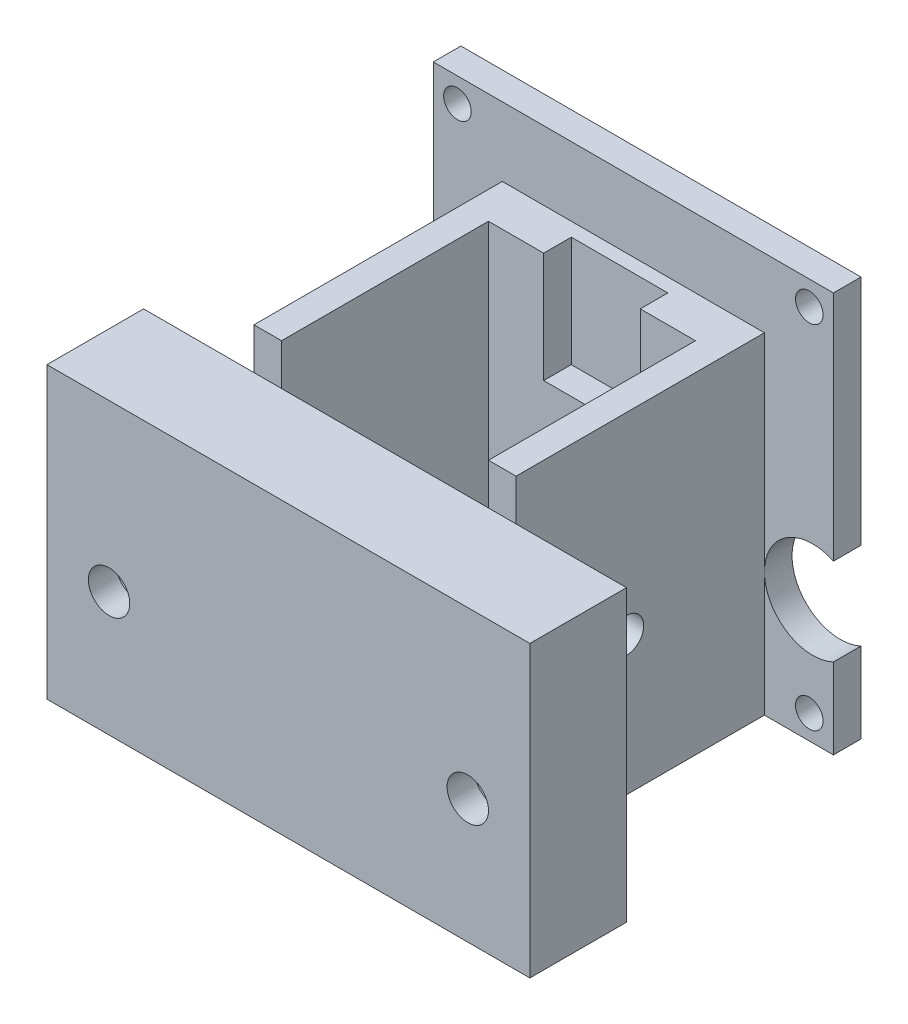
ISO-10303-21;
HEADER;
FILE_DESCRIPTION(('STEP AP214'),'2;1');
FILE_NAME('part.step','',(''),(''),'','','');
FILE_SCHEMA(('AUTOMOTIVE_DESIGN { 1 0 10303 214 1 1 1 1 }'));
ENDSEC;
DATA;
#1=APPLICATION_CONTEXT('core data for automotive mechanical design processes');
#2=APPLICATION_PROTOCOL_DEFINITION('international standard','automotive_design',2000,#1);
#3=PRODUCT_CONTEXT('',#1,'mechanical');
#4=PRODUCT('Part','Part','',(#3));
#5=PRODUCT_RELATED_PRODUCT_CATEGORY('part','',(#4));
#6=PRODUCT_DEFINITION_FORMATION('','',#4);
#7=PRODUCT_DEFINITION_CONTEXT('part definition',#1,'design');
#8=PRODUCT_DEFINITION('design','',#6,#7);
#9=PRODUCT_DEFINITION_SHAPE('','',#8);
#10=(LENGTH_UNIT() NAMED_UNIT(*) SI_UNIT(.MILLI.,.METRE.));
#11=(NAMED_UNIT(*) PLANE_ANGLE_UNIT() SI_UNIT($,.RADIAN.));
#12=(NAMED_UNIT(*) SI_UNIT($,.STERADIAN.) SOLID_ANGLE_UNIT());
#13=UNCERTAINTY_MEASURE_WITH_UNIT(LENGTH_MEASURE(1.E-05),#10,'distance_accuracy_value','');
#14=(GEOMETRIC_REPRESENTATION_CONTEXT(3) GLOBAL_UNCERTAINTY_ASSIGNED_CONTEXT((#13)) GLOBAL_UNIT_ASSIGNED_CONTEXT((#10,
#11,#12)) REPRESENTATION_CONTEXT('',''));
#15=CARTESIAN_POINT('',(0.,0.,0.));
#16=DIRECTION('',(0.,0.,1.));
#17=DIRECTION('',(1.,0.,0.));
#18=AXIS2_PLACEMENT_3D('',#15,#16,#17);
#19=CARTESIAN_POINT('',(0.,0.,2.));
#20=DIRECTION('',(0.,0.,-1.));
#21=DIRECTION('',(-1.,0.,0.));
#22=AXIS2_PLACEMENT_3D('',#19,#20,#21);
#23=PLANE('',#22);
#24=CARTESIAN_POINT('',(27.25,32.25,2.));
#25=DIRECTION('',(0.,0.,-1.));
#26=DIRECTION('',(-1.,0.,0.));
#27=AXIS2_PLACEMENT_3D('',#24,#25,#26);
#28=CIRCLE('',#27,1.);
#29=CARTESIAN_POINT('',(26.25,32.25,2.));
#30=VERTEX_POINT('',#29);
#31=EDGE_CURVE('E352',#30,#30,#28,.F.);
#32=ORIENTED_EDGE('',*,*,#31,.F.);
#33=EDGE_LOOP('',(#32));
#34=FACE_BOUND('',#33,.T.);
#35=CARTESIAN_POINT('',(1.75000000000002,32.25,2.));
#36=DIRECTION('',(0.,0.,-1.));
#37=DIRECTION('',(-1.,0.,0.));
#38=AXIS2_PLACEMENT_3D('',#35,#36,#37);
#39=CIRCLE('',#38,1.);
#40=CARTESIAN_POINT('',(0.750000000000014,32.25,2.));
#41=VERTEX_POINT('',#40);
#42=EDGE_CURVE('E366',#41,#41,#39,.F.);
#43=ORIENTED_EDGE('',*,*,#42,.F.);
#44=EDGE_LOOP('',(#43));
#45=FACE_BOUND('',#44,.T.);
#46=DIRECTION('',(0.,1.,0.));
#47=VECTOR('',#46,1.);
#48=CARTESIAN_POINT('',(24.,5.,2.));
#49=LINE('',#48,#47);
#50=CARTESIAN_POINT('',(24.,14.,2.));
#51=VERTEX_POINT('',#50);
#52=CARTESIAN_POINT('',(24.,29.,2.));
#53=VERTEX_POINT('',#52);
#54=EDGE_CURVE('E238',#51,#53,#49,.T.);
#55=ORIENTED_EDGE('',*,*,#54,.F.);
#56=CARTESIAN_POINT('',(27.5,14.,2.));
#57=DIRECTION('',(0.,0.,-1.));
#58=DIRECTION('',(-1.,0.,0.));
#59=AXIS2_PLACEMENT_3D('',#56,#57,#58);
#60=CIRCLE('',#59,3.5);
#61=CARTESIAN_POINT('',(29.,17.1622776601684,2.));
#62=VERTEX_POINT('',#61);
#63=EDGE_CURVE('E216',#62,#51,#60,.F.);
#64=ORIENTED_EDGE('',*,*,#63,.F.);
#65=DIRECTION('',(0.,1.,0.));
#66=VECTOR('',#65,1.);
#67=CARTESIAN_POINT('',(29.,0.,2.));
#68=LINE('',#67,#66);
#69=CARTESIAN_POINT('',(29.,34.,2.));
#70=VERTEX_POINT('',#69);
#71=EDGE_CURVE('E269',#62,#70,#68,.T.);
#72=ORIENTED_EDGE('',*,*,#71,.T.);
#73=DIRECTION('',(1.,0.,0.));
#74=VECTOR('',#73,1.);
#75=CARTESIAN_POINT('',(0.,34.,2.));
#76=LINE('',#75,#74);
#77=CARTESIAN_POINT('',(0.,34.,2.));
#78=VERTEX_POINT('',#77);
#79=EDGE_CURVE('E372',#78,#70,#76,.T.);
#80=ORIENTED_EDGE('',*,*,#79,.F.);
#81=DIRECTION('',(0.,-1.,0.));
#82=VECTOR('',#81,1.);
#83=CARTESIAN_POINT('',(0.,0.,2.));
#84=LINE('',#83,#82);
#85=CARTESIAN_POINT('',(0.,17.1622776601684,2.));
#86=VERTEX_POINT('',#85);
#87=EDGE_CURVE('E266',#78,#86,#84,.T.);
#88=ORIENTED_EDGE('',*,*,#87,.T.);
#89=CARTESIAN_POINT('',(1.5,14.,2.));
#90=DIRECTION('',(0.,0.,-1.));
#91=DIRECTION('',(-1.,0.,0.));
#92=AXIS2_PLACEMENT_3D('',#89,#90,#91);
#93=CIRCLE('',#92,3.5);
#94=CARTESIAN_POINT('',(5.,14.,2.));
#95=VERTEX_POINT('',#94);
#96=EDGE_CURVE('E598',#95,#86,#93,.F.);
#97=ORIENTED_EDGE('',*,*,#96,.F.);
#98=DIRECTION('',(0.,-1.,0.));
#99=VECTOR('',#98,1.);
#100=CARTESIAN_POINT('',(5.,5.,2.));
#101=LINE('',#100,#99);
#102=CARTESIAN_POINT('',(4.99999999999999,29.,2.));
#103=VERTEX_POINT('',#102);
#104=EDGE_CURVE('E243',#103,#95,#101,.T.);
#105=ORIENTED_EDGE('',*,*,#104,.F.);
#106=DIRECTION('',(1.,0.,0.));
#107=VECTOR('',#106,1.);
#108=CARTESIAN_POINT('',(0.,29.,2.));
#109=LINE('',#108,#107);
#110=EDGE_CURVE('E48',#103,#53,#109,.T.);
#111=ORIENTED_EDGE('',*,*,#110,.T.);
#112=EDGE_LOOP('',(#55,#64,#72,#80,#88,#97,#105,#111));
#113=FACE_BOUND('',#112,.T.);
#114=ADVANCED_FACE('F40',(#34,#45,#113),#23,.F.);
#115=CARTESIAN_POINT('',(27.25,6.75000000000003,2.));
#116=DIRECTION('',(0.,0.,-1.));
#117=DIRECTION('',(-1.,0.,0.));
#118=AXIS2_PLACEMENT_3D('',#115,#116,#117);
#119=CIRCLE('',#118,1.);
#120=CARTESIAN_POINT('',(26.25,6.75000000000003,2.));
#121=VERTEX_POINT('',#120);
#122=EDGE_CURVE('E353',#121,#121,#119,.F.);
#123=ORIENTED_EDGE('',*,*,#122,.F.);
#124=EDGE_LOOP('',(#123));
#125=FACE_BOUND('',#124,.T.);
#126=CARTESIAN_POINT('',(29.,5.,2.));
#127=VERTEX_POINT('',#126);
#128=CARTESIAN_POINT('',(29.,10.8377223398316,2.));
#129=VERTEX_POINT('',#128);
#130=EDGE_CURVE('E236',#127,#129,#68,.T.);
#131=ORIENTED_EDGE('',*,*,#130,.T.);
#132=EDGE_CURVE('E219',#51,#129,#60,.F.);
#133=ORIENTED_EDGE('',*,*,#132,.F.);
#134=CARTESIAN_POINT('',(24.,5.,2.));
#135=VERTEX_POINT('',#134);
#136=EDGE_CURVE('E233',#135,#51,#49,.T.);
#137=ORIENTED_EDGE('',*,*,#136,.F.);
#138=DIRECTION('',(-1.,0.,0.));
#139=VECTOR('',#138,1.);
#140=CARTESIAN_POINT('',(22.5,5.,2.));
#141=LINE('',#140,#139);
#142=EDGE_CURVE('E386',#127,#135,#141,.T.);
#143=ORIENTED_EDGE('',*,*,#142,.F.);
#144=EDGE_LOOP('',(#131,#133,#137,#143));
#145=FACE_BOUND('',#144,.T.);
#146=ADVANCED_FACE('F230',(#125,#145),#23,.F.);
#147=CARTESIAN_POINT('',(0.,0.,2.));
#148=DIRECTION('',(1.,0.,0.));
#149=DIRECTION('',(0.,1.,0.));
#150=AXIS2_PLACEMENT_3D('',#147,#148,#149);
#151=PLANE('',#150);
#152=CARTESIAN_POINT('',(0.,10.8377223398316,2.));
#153=VERTEX_POINT('',#152);
#154=CARTESIAN_POINT('',(0.,5.,2.));
#155=VERTEX_POINT('',#154);
#156=EDGE_CURVE('E270',#153,#155,#84,.T.);
#157=ORIENTED_EDGE('',*,*,#156,.F.);
#158=DIRECTION('',(0.,0.,-1.));
#159=VECTOR('',#158,1.);
#160=CARTESIAN_POINT('',(0.,10.8377223398316,11.8994949366117));
#161=LINE('',#160,#159);
#162=CARTESIAN_POINT('',(0.,10.8377223398316,0.));
#163=VERTEX_POINT('',#162);
#164=EDGE_CURVE('E496',#153,#163,#161,.T.);
#165=ORIENTED_EDGE('',*,*,#164,.T.);
#166=DIRECTION('',(0.,-1.,0.));
#167=VECTOR('',#166,1.);
#168=CARTESIAN_POINT('',(0.,0.,0.));
#169=LINE('',#168,#167);
#170=CARTESIAN_POINT('',(0.,5.,0.));
#171=VERTEX_POINT('',#170);
#172=EDGE_CURVE('E265',#163,#171,#169,.T.);
#173=ORIENTED_EDGE('',*,*,#172,.T.);
#174=DIRECTION('',(0.,0.,-1.));
#175=VECTOR('',#174,1.);
#176=CARTESIAN_POINT('',(0.,5.,10.2006097334284));
#177=LINE('',#176,#175);
#178=EDGE_CURVE('E381',#155,#171,#177,.T.);
#179=ORIENTED_EDGE('',*,*,#178,.F.);
#180=EDGE_LOOP('',(#157,#165,#173,#179));
#181=FACE_BOUND('',#180,.T.);
#182=ADVANCED_FACE('F492',(#181),#151,.F.);
#183=CARTESIAN_POINT('',(29.,0.,2.));
#184=DIRECTION('',(-1.,0.,0.));
#185=DIRECTION('',(0.,-1.,0.));
#186=AXIS2_PLACEMENT_3D('',#183,#184,#185);
#187=PLANE('',#186);
#188=ORIENTED_EDGE('',*,*,#71,.F.);
#189=DIRECTION('',(0.,0.,-1.));
#190=VECTOR('',#189,1.);
#191=CARTESIAN_POINT('',(29.,17.1622776601684,11.8994949366117));
#192=LINE('',#191,#190);
#193=CARTESIAN_POINT('',(29.,17.1622776601684,0.));
#194=VERTEX_POINT('',#193);
#195=EDGE_CURVE('E221',#62,#194,#192,.T.);
#196=ORIENTED_EDGE('',*,*,#195,.T.);
#197=DIRECTION('',(0.,1.,0.));
#198=VECTOR('',#197,1.);
#199=CARTESIAN_POINT('',(29.,0.,0.));
#200=LINE('',#199,#198);
#201=CARTESIAN_POINT('',(29.,34.,0.));
#202=VERTEX_POINT('',#201);
#203=EDGE_CURVE('E275',#194,#202,#200,.T.);
#204=ORIENTED_EDGE('',*,*,#203,.T.);
#205=DIRECTION('',(0.,0.,-1.));
#206=VECTOR('',#205,1.);
#207=CARTESIAN_POINT('',(29.,34.,2.));
#208=LINE('',#207,#206);
#209=EDGE_CURVE('E375',#70,#202,#208,.T.);
#210=ORIENTED_EDGE('',*,*,#209,.F.);
#211=EDGE_LOOP('',(#188,#196,#204,#210));
#212=FACE_BOUND('',#211,.T.);
#213=ADVANCED_FACE('F593',(#212),#187,.F.);
#214=CARTESIAN_POINT('',(0.,29.,2.));
#215=DIRECTION('',(0.,-1.,0.));
#216=DIRECTION('',(0.,0.,-1.));
#217=AXIS2_PLACEMENT_3D('',#214,#215,#216);
#218=PLANE('',#217);
#219=DIRECTION('',(1.,0.,0.));
#220=VECTOR('',#219,1.);
#221=CARTESIAN_POINT('',(-3.00000000000001,29.,20.));
#222=LINE('',#221,#220);
#223=CARTESIAN_POINT('',(22.,29.,20.));
#224=VERTEX_POINT('',#223);
#225=CARTESIAN_POINT('',(24.,29.,20.));
#226=VERTEX_POINT('',#225);
#227=EDGE_CURVE('E509',#224,#226,#222,.T.);
#228=ORIENTED_EDGE('',*,*,#227,.T.);
#229=DIRECTION('',(0.,0.,-1.));
#230=VECTOR('',#229,1.);
#231=CARTESIAN_POINT('',(24.,29.,20.));
#232=LINE('',#231,#230);
#233=EDGE_CURVE('E258',#226,#53,#232,.T.);
#234=ORIENTED_EDGE('',*,*,#233,.T.);
#235=ORIENTED_EDGE('',*,*,#110,.F.);
#236=DIRECTION('',(0.,0.,-1.));
#237=VECTOR('',#236,1.);
#238=CARTESIAN_POINT('',(5.,29.,20.));
#239=LINE('',#238,#237);
#240=CARTESIAN_POINT('',(5.,29.,20.));
#241=VERTEX_POINT('',#240);
#242=EDGE_CURVE('E255',#241,#103,#239,.T.);
#243=ORIENTED_EDGE('',*,*,#242,.F.);
#244=CARTESIAN_POINT('',(7.,29.,20.));
#245=VERTEX_POINT('',#244);
#246=EDGE_CURVE('E511',#241,#245,#222,.T.);
#247=ORIENTED_EDGE('',*,*,#246,.T.);
#248=DIRECTION('',(0.,0.,1.));
#249=VECTOR('',#248,1.);
#250=CARTESIAN_POINT('',(7.,29.,-26.3019433961698));
#251=LINE('',#250,#249);
#252=CARTESIAN_POINT('',(7.,29.,5.));
#253=VERTEX_POINT('',#252);
#254=EDGE_CURVE('E310',#253,#245,#251,.T.);
#255=ORIENTED_EDGE('',*,*,#254,.F.);
#256=DIRECTION('',(-1.,0.,0.));
#257=VECTOR('',#256,1.);
#258=CARTESIAN_POINT('',(7.,29.,5.));
#259=LINE('',#258,#257);
#260=CARTESIAN_POINT('',(11.,29.,5.));
#261=VERTEX_POINT('',#260);
#262=EDGE_CURVE('E314',#261,#253,#259,.T.);
#263=ORIENTED_EDGE('',*,*,#262,.F.);
#264=DIRECTION('',(0.,0.,1.));
#265=VECTOR('',#264,1.);
#266=CARTESIAN_POINT('',(11.,29.,3.));
#267=LINE('',#266,#265);
#268=CARTESIAN_POINT('',(11.,29.,3.));
#269=VERTEX_POINT('',#268);
#270=EDGE_CURVE('E413',#269,#261,#267,.T.);
#271=ORIENTED_EDGE('',*,*,#270,.F.);
#272=DIRECTION('',(-1.,0.,0.));
#273=VECTOR('',#272,1.);
#274=CARTESIAN_POINT('',(11.,29.,3.));
#275=LINE('',#274,#273);
#276=CARTESIAN_POINT('',(18.,29.,3.));
#277=VERTEX_POINT('',#276);
#278=EDGE_CURVE('E404',#277,#269,#275,.T.);
#279=ORIENTED_EDGE('',*,*,#278,.F.);
#280=DIRECTION('',(0.,0.,1.));
#281=VECTOR('',#280,1.);
#282=CARTESIAN_POINT('',(18.,29.,3.));
#283=LINE('',#282,#281);
#284=CARTESIAN_POINT('',(18.,29.,5.));
#285=VERTEX_POINT('',#284);
#286=EDGE_CURVE('E416',#277,#285,#283,.T.);
#287=ORIENTED_EDGE('',*,*,#286,.T.);
#288=CARTESIAN_POINT('',(22.,29.,5.));
#289=VERTEX_POINT('',#288);
#290=EDGE_CURVE('E311',#289,#285,#259,.T.);
#291=ORIENTED_EDGE('',*,*,#290,.F.);
#292=DIRECTION('',(0.,0.,1.));
#293=VECTOR('',#292,1.);
#294=CARTESIAN_POINT('',(22.,29.,-26.3019433961698));
#295=LINE('',#294,#293);
#296=EDGE_CURVE('E318',#289,#224,#295,.T.);
#297=ORIENTED_EDGE('',*,*,#296,.T.);
#298=EDGE_LOOP('',(#228,#234,#235,#243,#247,#255,#263,#271,#279,#287,#291,#297));
#299=FACE_BOUND('',#298,.T.);
#300=ADVANCED_FACE('F528',(#299),#218,.F.);
#301=CARTESIAN_POINT('',(1.74999999999998,6.74999999999998,2.));
#302=DIRECTION('',(0.,0.,-1.));
#303=DIRECTION('',(-1.,0.,0.));
#304=AXIS2_PLACEMENT_3D('',#301,#302,#303);
#305=CIRCLE('',#304,1.);
#306=CARTESIAN_POINT('',(0.74999999999998,6.74999999999998,2.));
#307=VERTEX_POINT('',#306);
#308=EDGE_CURVE('E344',#307,#307,#305,.F.);
#309=ORIENTED_EDGE('',*,*,#308,.F.);
#310=EDGE_LOOP('',(#309));
#311=FACE_BOUND('',#310,.T.);
#312=CARTESIAN_POINT('',(5.,5.,2.));
#313=VERTEX_POINT('',#312);
#314=EDGE_CURVE('E326',#95,#313,#101,.T.);
#315=ORIENTED_EDGE('',*,*,#314,.F.);
#316=EDGE_CURVE('E225',#153,#95,#93,.F.);
#317=ORIENTED_EDGE('',*,*,#316,.F.);
#318=ORIENTED_EDGE('',*,*,#156,.T.);
#319=DIRECTION('',(-1.,0.,0.));
#320=VECTOR('',#319,1.);
#321=CARTESIAN_POINT('',(5.5,5.,2.));
#322=LINE('',#321,#320);
#323=EDGE_CURVE('E387',#313,#155,#322,.T.);
#324=ORIENTED_EDGE('',*,*,#323,.F.);
#325=EDGE_LOOP('',(#315,#317,#318,#324));
#326=FACE_BOUND('',#325,.T.);
#327=ADVANCED_FACE('F578',(#311,#326),#23,.F.);
#328=CARTESIAN_POINT('',(0.,34.,0.));
#329=VERTEX_POINT('',#328);
#330=CARTESIAN_POINT('',(0.,17.1622776601684,0.));
#331=VERTEX_POINT('',#330);
#332=EDGE_CURVE('E272',#329,#331,#169,.T.);
#333=ORIENTED_EDGE('',*,*,#332,.T.);
#334=DIRECTION('',(0.,0.,-1.));
#335=VECTOR('',#334,1.);
#336=CARTESIAN_POINT('',(0.,17.1622776601684,11.8994949366117));
#337=LINE('',#336,#335);
#338=EDGE_CURVE('E55',#331,#86,#337,.F.);
#339=ORIENTED_EDGE('',*,*,#338,.T.);
#340=ORIENTED_EDGE('',*,*,#87,.F.);
#341=DIRECTION('',(0.,0.,1.));
#342=VECTOR('',#341,1.);
#343=CARTESIAN_POINT('',(0.,34.,2.));
#344=LINE('',#343,#342);
#345=EDGE_CURVE('E369',#329,#78,#344,.T.);
#346=ORIENTED_EDGE('',*,*,#345,.F.);
#347=EDGE_LOOP('',(#333,#339,#340,#346));
#348=FACE_BOUND('',#347,.T.);
#349=ADVANCED_FACE('F42',(#348),#151,.F.);
#350=CARTESIAN_POINT('',(29.,5.,0.));
#351=VERTEX_POINT('',#350);
#352=CARTESIAN_POINT('',(29.,10.8377223398316,0.));
#353=VERTEX_POINT('',#352);
#354=EDGE_CURVE('E276',#351,#353,#200,.T.);
#355=ORIENTED_EDGE('',*,*,#354,.T.);
#356=DIRECTION('',(0.,0.,-1.));
#357=VECTOR('',#356,1.);
#358=CARTESIAN_POINT('',(29.,10.8377223398316,11.8994949366117));
#359=LINE('',#358,#357);
#360=EDGE_CURVE('E62',#353,#129,#359,.F.);
#361=ORIENTED_EDGE('',*,*,#360,.T.);
#362=ORIENTED_EDGE('',*,*,#130,.F.);
#363=DIRECTION('',(0.,0.,-1.));
#364=VECTOR('',#363,1.);
#365=CARTESIAN_POINT('',(29.,5.,10.2006097334284));
#366=LINE('',#365,#364);
#367=EDGE_CURVE('E383',#127,#351,#366,.T.);
#368=ORIENTED_EDGE('',*,*,#367,.T.);
#369=EDGE_LOOP('',(#355,#361,#362,#368));
#370=FACE_BOUND('',#369,.T.);
#371=ADVANCED_FACE('F502',(#370),#187,.F.);
#372=CARTESIAN_POINT('',(0.,0.,0.));
#373=DIRECTION('',(0.,0.,-1.));
#374=DIRECTION('',(-1.,0.,0.));
#375=AXIS2_PLACEMENT_3D('',#372,#373,#374);
#376=PLANE('',#375);
#377=CARTESIAN_POINT('',(27.5,14.,0.));
#378=DIRECTION('',(0.,0.,-1.));
#379=DIRECTION('',(-1.,0.,0.));
#380=AXIS2_PLACEMENT_3D('',#377,#378,#379);
#381=CIRCLE('',#380,3.5);
#382=EDGE_CURVE('E13',#353,#194,#381,.T.);
#383=ORIENTED_EDGE('',*,*,#382,.F.);
#384=ORIENTED_EDGE('',*,*,#354,.F.);
#385=DIRECTION('',(1.,0.,0.));
#386=VECTOR('',#385,1.);
#387=CARTESIAN_POINT('',(5.5,5.,0.));
#388=LINE('',#387,#386);
#389=EDGE_CURVE('E430',#171,#351,#388,.T.);
#390=ORIENTED_EDGE('',*,*,#389,.F.);
#391=ORIENTED_EDGE('',*,*,#172,.F.);
#392=CARTESIAN_POINT('',(1.5,14.,0.));
#393=DIRECTION('',(0.,0.,-1.));
#394=DIRECTION('',(-1.,0.,0.));
#395=AXIS2_PLACEMENT_3D('',#392,#393,#394);
#396=CIRCLE('',#395,3.5);
#397=EDGE_CURVE('E600',#331,#163,#396,.T.);
#398=ORIENTED_EDGE('',*,*,#397,.F.);
#399=ORIENTED_EDGE('',*,*,#332,.F.);
#400=DIRECTION('',(-1.,0.,0.));
#401=VECTOR('',#400,1.);
#402=CARTESIAN_POINT('',(0.,34.,0.));
#403=LINE('',#402,#401);
#404=EDGE_CURVE('E378',#202,#329,#403,.T.);
#405=ORIENTED_EDGE('',*,*,#404,.F.);
#406=ORIENTED_EDGE('',*,*,#203,.F.);
#407=EDGE_LOOP('',(#383,#384,#390,#391,#398,#399,#405,#406));
#408=FACE_BOUND('',#407,.T.);
#409=CARTESIAN_POINT('',(1.74999999999998,6.74999999999998,0.));
#410=DIRECTION('',(0.,0.,-1.));
#411=DIRECTION('',(-1.,0.,0.));
#412=AXIS2_PLACEMENT_3D('',#409,#410,#411);
#413=CIRCLE('',#412,1.);
#414=CARTESIAN_POINT('',(0.74999999999998,6.74999999999998,0.));
#415=VERTEX_POINT('',#414);
#416=EDGE_CURVE('E340',#415,#415,#413,.T.);
#417=ORIENTED_EDGE('',*,*,#416,.F.);
#418=EDGE_LOOP('',(#417));
#419=FACE_BOUND('',#418,.T.);
#420=CARTESIAN_POINT('',(27.25,6.75000000000003,0.));
#421=DIRECTION('',(0.,0.,-1.));
#422=DIRECTION('',(-1.,0.,0.));
#423=AXIS2_PLACEMENT_3D('',#420,#421,#422);
#424=CIRCLE('',#423,1.);
#425=CARTESIAN_POINT('',(26.25,6.75000000000003,0.));
#426=VERTEX_POINT('',#425);
#427=EDGE_CURVE('E357',#426,#426,#424,.T.);
#428=ORIENTED_EDGE('',*,*,#427,.F.);
#429=EDGE_LOOP('',(#428));
#430=FACE_BOUND('',#429,.T.);
#431=CARTESIAN_POINT('',(27.25,32.25,0.));
#432=DIRECTION('',(0.,0.,-1.));
#433=DIRECTION('',(-1.,0.,0.));
#434=AXIS2_PLACEMENT_3D('',#431,#432,#433);
#435=CIRCLE('',#434,1.);
#436=CARTESIAN_POINT('',(26.25,32.25,0.));
#437=VERTEX_POINT('',#436);
#438=EDGE_CURVE('E349',#437,#437,#435,.T.);
#439=ORIENTED_EDGE('',*,*,#438,.F.);
#440=EDGE_LOOP('',(#439));
#441=FACE_BOUND('',#440,.T.);
#442=CARTESIAN_POINT('',(1.75000000000002,32.25,0.));
#443=DIRECTION('',(0.,0.,-1.));
#444=DIRECTION('',(-1.,0.,0.));
#445=AXIS2_PLACEMENT_3D('',#442,#443,#444);
#446=CIRCLE('',#445,1.);
#447=CARTESIAN_POINT('',(0.750000000000014,32.25,0.));
#448=VERTEX_POINT('',#447);
#449=EDGE_CURVE('E356',#448,#448,#446,.T.);
#450=ORIENTED_EDGE('',*,*,#449,.F.);
#451=EDGE_LOOP('',(#450));
#452=FACE_BOUND('',#451,.T.);
#453=ADVANCED_FACE('F499',(#408,#419,#430,#441,#452),#376,.T.);
#454=CARTESIAN_POINT('',(5.,5.,20.));
#455=DIRECTION('',(1.,0.,0.));
#456=DIRECTION('',(0.,0.,-1.));
#457=AXIS2_PLACEMENT_3D('',#454,#455,#456);
#458=PLANE('',#457);
#459=CARTESIAN_POINT('',(5.,15.,12.));
#460=DIRECTION('',(-1.,0.,0.));
#461=DIRECTION('',(0.,0.,1.));
#462=AXIS2_PLACEMENT_3D('',#459,#460,#461);
#463=CIRCLE('',#462,1.25);
#464=CARTESIAN_POINT('',(5.,15.,13.25));
#465=VERTEX_POINT('',#464);
#466=EDGE_CURVE('E288',#465,#465,#463,.T.);
#467=ORIENTED_EDGE('',*,*,#466,.F.);
#468=EDGE_LOOP('',(#467));
#469=FACE_BOUND('',#468,.T.);
#470=ORIENTED_EDGE('',*,*,#104,.T.);
#471=ORIENTED_EDGE('',*,*,#314,.T.);
#472=DIRECTION('',(0.,0.,-1.));
#473=VECTOR('',#472,1.);
#474=CARTESIAN_POINT('',(5.,5.,20.));
#475=LINE('',#474,#473);
#476=CARTESIAN_POINT('',(5.,5.,20.));
#477=VERTEX_POINT('',#476);
#478=EDGE_CURVE('E262',#477,#313,#475,.T.);
#479=ORIENTED_EDGE('',*,*,#478,.F.);
#480=DIRECTION('',(0.,-1.,0.));
#481=VECTOR('',#480,1.);
#482=CARTESIAN_POINT('',(5.,5.,20.));
#483=LINE('',#482,#481);
#484=CARTESIAN_POINT('',(5.,26.,20.));
#485=VERTEX_POINT('',#484);
#486=EDGE_CURVE('E249',#485,#477,#483,.T.);
#487=ORIENTED_EDGE('',*,*,#486,.F.);
#488=EDGE_CURVE('E250',#241,#485,#483,.T.);
#489=ORIENTED_EDGE('',*,*,#488,.F.);
#490=ORIENTED_EDGE('',*,*,#242,.T.);
#491=EDGE_LOOP('',(#470,#471,#479,#487,#489,#490));
#492=FACE_BOUND('',#491,.T.);
#493=ADVANCED_FACE('F485',(#469,#492),#458,.F.);
#494=CARTESIAN_POINT('',(5.,5.,20.));
#495=DIRECTION('',(0.,1.,0.));
#496=DIRECTION('',(0.,0.,1.));
#497=AXIS2_PLACEMENT_3D('',#494,#495,#496);
#498=PLANE('',#497);
#499=ORIENTED_EDGE('',*,*,#142,.T.);
#500=DIRECTION('',(0.,0.,-1.));
#501=VECTOR('',#500,1.);
#502=CARTESIAN_POINT('',(24.,5.,20.));
#503=LINE('',#502,#501);
#504=CARTESIAN_POINT('',(24.,5.,20.));
#505=VERTEX_POINT('',#504);
#506=EDGE_CURVE('E248',#505,#135,#503,.T.);
#507=ORIENTED_EDGE('',*,*,#506,.F.);
#508=DIRECTION('',(1.,0.,0.));
#509=VECTOR('',#508,1.);
#510=CARTESIAN_POINT('',(32.,5.,20.));
#511=LINE('',#510,#509);
#512=CARTESIAN_POINT('',(32.,5.,20.));
#513=VERTEX_POINT('',#512);
#514=EDGE_CURVE('E335',#505,#513,#511,.T.);
#515=ORIENTED_EDGE('',*,*,#514,.T.);
#516=DIRECTION('',(0.,0.,-1.));
#517=VECTOR('',#516,1.);
#518=CARTESIAN_POINT('',(32.,5.,27.));
#519=LINE('',#518,#517);
#520=CARTESIAN_POINT('',(32.,5.,27.));
#521=VERTEX_POINT('',#520);
#522=EDGE_CURVE('E457',#521,#513,#519,.T.);
#523=ORIENTED_EDGE('',*,*,#522,.F.);
#524=DIRECTION('',(1.,0.,0.));
#525=VECTOR('',#524,1.);
#526=CARTESIAN_POINT('',(32.,5.,27.));
#527=LINE('',#526,#525);
#528=CARTESIAN_POINT('',(-3.00000000000001,5.,27.));
#529=VERTEX_POINT('',#528);
#530=EDGE_CURVE('E455',#529,#521,#527,.T.);
#531=ORIENTED_EDGE('',*,*,#530,.F.);
#532=DIRECTION('',(0.,0.,-1.));
#533=VECTOR('',#532,1.);
#534=CARTESIAN_POINT('',(-3.00000000000001,5.,27.));
#535=LINE('',#534,#533);
#536=CARTESIAN_POINT('',(-3.00000000000001,5.,20.));
#537=VERTEX_POINT('',#536);
#538=EDGE_CURVE('E293',#529,#537,#535,.T.);
#539=ORIENTED_EDGE('',*,*,#538,.T.);
#540=EDGE_CURVE('E453',#537,#477,#511,.T.);
#541=ORIENTED_EDGE('',*,*,#540,.T.);
#542=ORIENTED_EDGE('',*,*,#478,.T.);
#543=ORIENTED_EDGE('',*,*,#323,.T.);
#544=ORIENTED_EDGE('',*,*,#178,.T.);
#545=ORIENTED_EDGE('',*,*,#389,.T.);
#546=ORIENTED_EDGE('',*,*,#367,.F.);
#547=EDGE_LOOP('',(#499,#507,#515,#523,#531,#539,#541,#542,#543,#544,#545,#546));
#548=FACE_BOUND('',#547,.T.);
#549=CARTESIAN_POINT('',(7.,5.,20.));
#550=VERTEX_POINT('',#549);
#551=CARTESIAN_POINT('',(22.,5.,20.));
#552=VERTEX_POINT('',#551);
#553=EDGE_CURVE('E463',#550,#552,#511,.T.);
#554=ORIENTED_EDGE('',*,*,#553,.T.);
#555=DIRECTION('',(0.,0.,1.));
#556=VECTOR('',#555,1.);
#557=CARTESIAN_POINT('',(22.,5.,-26.3019433961698));
#558=LINE('',#557,#556);
#559=CARTESIAN_POINT('',(22.,5.,5.));
#560=VERTEX_POINT('',#559);
#561=EDGE_CURVE('E306',#560,#552,#558,.T.);
#562=ORIENTED_EDGE('',*,*,#561,.F.);
#563=DIRECTION('',(1.,0.,0.));
#564=VECTOR('',#563,1.);
#565=CARTESIAN_POINT('',(7.,5.,5.));
#566=LINE('',#565,#564);
#567=CARTESIAN_POINT('',(7.,5.,5.));
#568=VERTEX_POINT('',#567);
#569=EDGE_CURVE('E300',#568,#560,#566,.T.);
#570=ORIENTED_EDGE('',*,*,#569,.F.);
#571=DIRECTION('',(0.,0.,1.));
#572=VECTOR('',#571,1.);
#573=CARTESIAN_POINT('',(7.,5.,-26.3019433961698));
#574=LINE('',#573,#572);
#575=EDGE_CURVE('E309',#568,#550,#574,.T.);
#576=ORIENTED_EDGE('',*,*,#575,.T.);
#577=EDGE_LOOP('',(#554,#562,#570,#576));
#578=FACE_BOUND('',#577,.T.);
#579=ADVANCED_FACE('F470',(#548,#578),#498,.F.);
#580=CARTESIAN_POINT('',(24.,5.,20.));
#581=DIRECTION('',(-1.,0.,0.));
#582=DIRECTION('',(0.,0.,1.));
#583=AXIS2_PLACEMENT_3D('',#580,#581,#582);
#584=PLANE('',#583);
#585=CARTESIAN_POINT('',(24.,15.,12.));
#586=DIRECTION('',(-1.,0.,0.));
#587=DIRECTION('',(0.,0.,1.));
#588=AXIS2_PLACEMENT_3D('',#585,#586,#587);
#589=CIRCLE('',#588,1.25);
#590=CARTESIAN_POINT('',(24.,15.,13.25));
#591=VERTEX_POINT('',#590);
#592=EDGE_CURVE('E281',#591,#591,#589,.F.);
#593=ORIENTED_EDGE('',*,*,#592,.F.);
#594=EDGE_LOOP('',(#593));
#595=FACE_BOUND('',#594,.T.);
#596=ORIENTED_EDGE('',*,*,#136,.T.);
#597=ORIENTED_EDGE('',*,*,#54,.T.);
#598=ORIENTED_EDGE('',*,*,#233,.F.);
#599=DIRECTION('',(0.,1.,0.));
#600=VECTOR('',#599,1.);
#601=CARTESIAN_POINT('',(24.,5.,20.));
#602=LINE('',#601,#600);
#603=CARTESIAN_POINT('',(24.,26.,20.));
#604=VERTEX_POINT('',#603);
#605=EDGE_CURVE('E337',#604,#226,#602,.T.);
#606=ORIENTED_EDGE('',*,*,#605,.F.);
#607=DIRECTION('',(0.,1.,0.));
#608=VECTOR('',#607,1.);
#609=CARTESIAN_POINT('',(24.,5.,20.));
#610=LINE('',#609,#608);
#611=EDGE_CURVE('E259',#505,#604,#610,.T.);
#612=ORIENTED_EDGE('',*,*,#611,.F.);
#613=ORIENTED_EDGE('',*,*,#506,.T.);
#614=EDGE_LOOP('',(#596,#597,#598,#606,#612,#613));
#615=FACE_BOUND('',#614,.T.);
#616=ADVANCED_FACE('F245',(#595,#615),#584,.F.);
#617=CARTESIAN_POINT('',(0.,0.,5.));
#618=DIRECTION('',(0.,0.,-1.));
#619=DIRECTION('',(-1.,0.,0.));
#620=AXIS2_PLACEMENT_3D('',#617,#618,#619);
#621=PLANE('',#620);
#622=DIRECTION('',(1.,0.,0.));
#623=VECTOR('',#622,1.);
#624=CARTESIAN_POINT('',(11.,21.,5.));
#625=LINE('',#624,#623);
#626=CARTESIAN_POINT('',(11.,21.,5.));
#627=VERTEX_POINT('',#626);
#628=CARTESIAN_POINT('',(18.,21.,5.));
#629=VERTEX_POINT('',#628);
#630=EDGE_CURVE('E409',#627,#629,#625,.T.);
#631=ORIENTED_EDGE('',*,*,#630,.F.);
#632=DIRECTION('',(0.,-1.,0.));
#633=VECTOR('',#632,1.);
#634=CARTESIAN_POINT('',(11.,29.,5.));
#635=LINE('',#634,#633);
#636=EDGE_CURVE('E389',#261,#627,#635,.T.);
#637=ORIENTED_EDGE('',*,*,#636,.F.);
#638=ORIENTED_EDGE('',*,*,#262,.T.);
#639=DIRECTION('',(0.,-1.,0.));
#640=VECTOR('',#639,1.);
#641=CARTESIAN_POINT('',(7.,5.,5.));
#642=LINE('',#641,#640);
#643=EDGE_CURVE('E307',#253,#568,#642,.T.);
#644=ORIENTED_EDGE('',*,*,#643,.T.);
#645=ORIENTED_EDGE('',*,*,#569,.T.);
#646=DIRECTION('',(0.,1.,0.));
#647=VECTOR('',#646,1.);
#648=CARTESIAN_POINT('',(22.,5.,5.));
#649=LINE('',#648,#647);
#650=EDGE_CURVE('E315',#560,#289,#649,.T.);
#651=ORIENTED_EDGE('',*,*,#650,.T.);
#652=ORIENTED_EDGE('',*,*,#290,.T.);
#653=DIRECTION('',(0.,1.,0.));
#654=VECTOR('',#653,1.);
#655=CARTESIAN_POINT('',(18.,29.,5.));
#656=LINE('',#655,#654);
#657=EDGE_CURVE('E398',#629,#285,#656,.T.);
#658=ORIENTED_EDGE('',*,*,#657,.F.);
#659=EDGE_LOOP('',(#631,#637,#638,#644,#645,#651,#652,#658));
#660=FACE_BOUND('',#659,.T.);
#661=ADVANCED_FACE('F538',(#660),#621,.F.);
#662=CARTESIAN_POINT('',(22.,5.,-26.3019433961698));
#663=DIRECTION('',(1.,0.,0.));
#664=DIRECTION('',(0.,0.,-1.));
#665=AXIS2_PLACEMENT_3D('',#662,#663,#664);
#666=PLANE('',#665);
#667=CARTESIAN_POINT('',(22.,15.,12.));
#668=DIRECTION('',(1.,0.,0.));
#669=DIRECTION('',(0.,0.,-1.));
#670=AXIS2_PLACEMENT_3D('',#667,#668,#669);
#671=CIRCLE('',#670,1.25);
#672=CARTESIAN_POINT('',(22.,15.,10.75));
#673=VERTEX_POINT('',#672);
#674=EDGE_CURVE('E280',#673,#673,#671,.T.);
#675=ORIENTED_EDGE('',*,*,#674,.T.);
#676=EDGE_LOOP('',(#675));
#677=FACE_BOUND('',#676,.T.);
#678=ORIENTED_EDGE('',*,*,#561,.T.);
#679=DIRECTION('',(0.,1.,0.));
#680=VECTOR('',#679,1.);
#681=CARTESIAN_POINT('',(22.,5.,20.));
#682=LINE('',#681,#680);
#683=CARTESIAN_POINT('',(22.,26.,20.));
#684=VERTEX_POINT('',#683);
#685=EDGE_CURVE('E297',#552,#684,#682,.T.);
#686=ORIENTED_EDGE('',*,*,#685,.T.);
#687=DIRECTION('',(0.,-1.,0.));
#688=VECTOR('',#687,1.);
#689=CARTESIAN_POINT('',(22.,5.,20.));
#690=LINE('',#689,#688);
#691=EDGE_CURVE('E341',#224,#684,#690,.T.);
#692=ORIENTED_EDGE('',*,*,#691,.F.);
#693=ORIENTED_EDGE('',*,*,#296,.F.);
#694=ORIENTED_EDGE('',*,*,#650,.F.);
#695=EDGE_LOOP('',(#678,#686,#692,#693,#694));
#696=FACE_BOUND('',#695,.T.);
#697=ADVANCED_FACE('F554',(#677,#696),#666,.F.);
#698=CARTESIAN_POINT('',(7.,5.,-26.3019433961698));
#699=DIRECTION('',(-1.,0.,0.));
#700=DIRECTION('',(0.,0.,1.));
#701=AXIS2_PLACEMENT_3D('',#698,#699,#700);
#702=PLANE('',#701);
#703=CARTESIAN_POINT('',(7.,15.,12.));
#704=DIRECTION('',(-1.,0.,0.));
#705=DIRECTION('',(0.,0.,1.));
#706=AXIS2_PLACEMENT_3D('',#703,#704,#705);
#707=CIRCLE('',#706,1.25);
#708=CARTESIAN_POINT('',(7.,15.,13.25));
#709=VERTEX_POINT('',#708);
#710=EDGE_CURVE('E278',#709,#709,#707,.T.);
#711=ORIENTED_EDGE('',*,*,#710,.T.);
#712=EDGE_LOOP('',(#711));
#713=FACE_BOUND('',#712,.T.);
#714=ORIENTED_EDGE('',*,*,#254,.T.);
#715=DIRECTION('',(0.,-1.,0.));
#716=VECTOR('',#715,1.);
#717=CARTESIAN_POINT('',(7.,5.,20.));
#718=LINE('',#717,#716);
#719=CARTESIAN_POINT('',(7.,26.,20.));
#720=VERTEX_POINT('',#719);
#721=EDGE_CURVE('E301',#245,#720,#718,.T.);
#722=ORIENTED_EDGE('',*,*,#721,.T.);
#723=EDGE_CURVE('E285',#720,#550,#718,.T.);
#724=ORIENTED_EDGE('',*,*,#723,.T.);
#725=ORIENTED_EDGE('',*,*,#575,.F.);
#726=ORIENTED_EDGE('',*,*,#643,.F.);
#727=EDGE_LOOP('',(#714,#722,#724,#725,#726));
#728=FACE_BOUND('',#727,.T.);
#729=ADVANCED_FACE('F533',(#713,#728),#702,.F.);
#730=CARTESIAN_POINT('',(27.5355339059327,15.,12.));
#731=DIRECTION('',(-1.,0.,0.));
#732=DIRECTION('',(0.,0.,1.));
#733=AXIS2_PLACEMENT_3D('',#730,#731,#732);
#734=CYLINDRICAL_SURFACE('',#733,1.25);
#735=ORIENTED_EDGE('',*,*,#466,.T.);
#736=EDGE_LOOP('',(#735));
#737=FACE_BOUND('',#736,.T.);
#738=ORIENTED_EDGE('',*,*,#710,.F.);
#739=EDGE_LOOP('',(#738));
#740=FACE_BOUND('',#739,.T.);
#741=ADVANCED_FACE('F731',(#737,#740),#734,.F.);
#742=ORIENTED_EDGE('',*,*,#592,.T.);
#743=EDGE_LOOP('',(#742));
#744=FACE_BOUND('',#743,.T.);
#745=ORIENTED_EDGE('',*,*,#674,.F.);
#746=EDGE_LOOP('',(#745));
#747=FACE_BOUND('',#746,.T.);
#748=ADVANCED_FACE('F721',(#744,#747),#734,.F.);
#749=CARTESIAN_POINT('',(0.,0.,20.));
#750=DIRECTION('',(0.,0.,1.));
#751=DIRECTION('',(1.,0.,0.));
#752=AXIS2_PLACEMENT_3D('',#749,#750,#751);
#753=PLANE('',#752);
#754=CARTESIAN_POINT('',(1.5,14.,20.));
#755=DIRECTION('',(0.,0.,-1.));
#756=DIRECTION('',(-1.,0.,0.));
#757=AXIS2_PLACEMENT_3D('',#754,#755,#756);
#758=CIRCLE('',#757,2.);
#759=CARTESIAN_POINT('',(-0.5,14.,20.));
#760=VERTEX_POINT('',#759);
#761=EDGE_CURVE('E436',#760,#760,#758,.T.);
#762=ORIENTED_EDGE('',*,*,#761,.F.);
#763=EDGE_LOOP('',(#762));
#764=FACE_BOUND('',#763,.T.);
#765=DIRECTION('',(0.,-1.,0.));
#766=VECTOR('',#765,1.);
#767=CARTESIAN_POINT('',(-3.00000000000001,5.,20.));
#768=LINE('',#767,#766);
#769=CARTESIAN_POINT('',(-3.00000000000001,26.,20.));
#770=VERTEX_POINT('',#769);
#771=EDGE_CURVE('E459',#770,#537,#768,.T.);
#772=ORIENTED_EDGE('',*,*,#771,.F.);
#773=DIRECTION('',(-1.,0.,0.));
#774=VECTOR('',#773,1.);
#775=CARTESIAN_POINT('',(-3.00000000000001,26.,20.));
#776=LINE('',#775,#774);
#777=EDGE_CURVE('E481',#485,#770,#776,.T.);
#778=ORIENTED_EDGE('',*,*,#777,.F.);
#779=ORIENTED_EDGE('',*,*,#486,.T.);
#780=ORIENTED_EDGE('',*,*,#540,.F.);
#781=EDGE_LOOP('',(#772,#778,#779,#780));
#782=FACE_BOUND('',#781,.T.);
#783=ADVANCED_FACE('F478',(#764,#782),#753,.F.);
#784=CARTESIAN_POINT('',(27.5,14.,20.));
#785=DIRECTION('',(0.,0.,-1.));
#786=DIRECTION('',(-1.,0.,0.));
#787=AXIS2_PLACEMENT_3D('',#784,#785,#786);
#788=CIRCLE('',#787,2.00000000000001);
#789=CARTESIAN_POINT('',(25.5,14.,20.));
#790=VERTEX_POINT('',#789);
#791=EDGE_CURVE('E441',#790,#790,#788,.T.);
#792=ORIENTED_EDGE('',*,*,#791,.F.);
#793=EDGE_LOOP('',(#792));
#794=FACE_BOUND('',#793,.T.);
#795=ORIENTED_EDGE('',*,*,#611,.T.);
#796=CARTESIAN_POINT('',(32.,26.,20.));
#797=VERTEX_POINT('',#796);
#798=EDGE_CURVE('E333',#797,#604,#776,.T.);
#799=ORIENTED_EDGE('',*,*,#798,.F.);
#800=DIRECTION('',(0.,1.,0.));
#801=VECTOR('',#800,1.);
#802=CARTESIAN_POINT('',(32.,5.,20.));
#803=LINE('',#802,#801);
#804=EDGE_CURVE('E440',#513,#797,#803,.T.);
#805=ORIENTED_EDGE('',*,*,#804,.F.);
#806=ORIENTED_EDGE('',*,*,#514,.F.);
#807=EDGE_LOOP('',(#795,#799,#805,#806));
#808=FACE_BOUND('',#807,.T.);
#809=ADVANCED_FACE('F330',(#794,#808),#753,.F.);
#810=ORIENTED_EDGE('',*,*,#723,.F.);
#811=EDGE_CURVE('E520',#684,#720,#776,.T.);
#812=ORIENTED_EDGE('',*,*,#811,.F.);
#813=ORIENTED_EDGE('',*,*,#685,.F.);
#814=ORIENTED_EDGE('',*,*,#553,.F.);
#815=EDGE_LOOP('',(#810,#812,#813,#814));
#816=FACE_BOUND('',#815,.T.);
#817=ADVANCED_FACE('F562',(#816),#753,.F.);
#818=CARTESIAN_POINT('',(32.,5.,27.));
#819=DIRECTION('',(-1.,0.,0.));
#820=DIRECTION('',(0.,-1.,0.));
#821=AXIS2_PLACEMENT_3D('',#818,#819,#820);
#822=PLANE('',#821);
#823=ORIENTED_EDGE('',*,*,#804,.T.);
#824=DIRECTION('',(0.,0.,1.));
#825=VECTOR('',#824,1.);
#826=CARTESIAN_POINT('',(32.,26.,-15.1283361405006));
#827=LINE('',#826,#825);
#828=CARTESIAN_POINT('',(32.,26.,27.));
#829=VERTEX_POINT('',#828);
#830=EDGE_CURVE('E512',#797,#829,#827,.T.);
#831=ORIENTED_EDGE('',*,*,#830,.T.);
#832=DIRECTION('',(0.,1.,0.));
#833=VECTOR('',#832,1.);
#834=CARTESIAN_POINT('',(32.,5.,27.));
#835=LINE('',#834,#833);
#836=EDGE_CURVE('E449',#521,#829,#835,.T.);
#837=ORIENTED_EDGE('',*,*,#836,.F.);
#838=ORIENTED_EDGE('',*,*,#522,.T.);
#839=EDGE_LOOP('',(#823,#831,#837,#838));
#840=FACE_BOUND('',#839,.T.);
#841=ADVANCED_FACE('F725',(#840),#822,.F.);
#842=CARTESIAN_POINT('',(-3.00000000000001,5.,27.));
#843=DIRECTION('',(1.,0.,0.));
#844=DIRECTION('',(0.,0.,-1.));
#845=AXIS2_PLACEMENT_3D('',#842,#843,#844);
#846=PLANE('',#845);
#847=DIRECTION('',(0.,-1.,0.));
#848=VECTOR('',#847,1.);
#849=CARTESIAN_POINT('',(-3.00000000000001,5.,27.));
#850=LINE('',#849,#848);
#851=CARTESIAN_POINT('',(-3.00000000000001,26.,27.));
#852=VERTEX_POINT('',#851);
#853=EDGE_CURVE('E452',#852,#529,#850,.T.);
#854=ORIENTED_EDGE('',*,*,#853,.F.);
#855=DIRECTION('',(0.,0.,1.));
#856=VECTOR('',#855,1.);
#857=CARTESIAN_POINT('',(-3.00000000000001,26.,-15.1283361405006));
#858=LINE('',#857,#856);
#859=EDGE_CURVE('E514',#770,#852,#858,.T.);
#860=ORIENTED_EDGE('',*,*,#859,.F.);
#861=ORIENTED_EDGE('',*,*,#771,.T.);
#862=ORIENTED_EDGE('',*,*,#538,.F.);
#863=EDGE_LOOP('',(#854,#860,#861,#862));
#864=FACE_BOUND('',#863,.T.);
#865=ADVANCED_FACE('F717',(#864),#846,.F.);
#866=CARTESIAN_POINT('',(0.,0.,27.));
#867=DIRECTION('',(0.,0.,1.));
#868=DIRECTION('',(1.,0.,0.));
#869=AXIS2_PLACEMENT_3D('',#866,#867,#868);
#870=PLANE('',#869);
#871=DIRECTION('',(1.,0.,0.));
#872=VECTOR('',#871,1.);
#873=CARTESIAN_POINT('',(-3.00000000000001,26.,27.));
#874=LINE('',#873,#872);
#875=EDGE_CURVE('E504',#852,#829,#874,.T.);
#876=ORIENTED_EDGE('',*,*,#875,.F.);
#877=ORIENTED_EDGE('',*,*,#853,.T.);
#878=ORIENTED_EDGE('',*,*,#530,.T.);
#879=ORIENTED_EDGE('',*,*,#836,.T.);
#880=EDGE_LOOP('',(#876,#877,#878,#879));
#881=FACE_BOUND('',#880,.T.);
#882=CARTESIAN_POINT('',(27.5,14.,27.));
#883=DIRECTION('',(0.,0.,1.));
#884=DIRECTION('',(1.,0.,0.));
#885=AXIS2_PLACEMENT_3D('',#882,#883,#884);
#886=CIRCLE('',#885,1.5);
#887=CARTESIAN_POINT('',(29.,14.,27.));
#888=VERTEX_POINT('',#887);
#889=EDGE_CURVE('E426',#888,#888,#886,.F.);
#890=ORIENTED_EDGE('',*,*,#889,.T.);
#891=EDGE_LOOP('',(#890));
#892=FACE_BOUND('',#891,.T.);
#893=CARTESIAN_POINT('',(1.5,14.,27.));
#894=DIRECTION('',(0.,0.,1.));
#895=DIRECTION('',(1.,0.,0.));
#896=AXIS2_PLACEMENT_3D('',#893,#894,#895);
#897=CIRCLE('',#896,1.5);
#898=CARTESIAN_POINT('',(3.,14.,27.));
#899=VERTEX_POINT('',#898);
#900=EDGE_CURVE('E427',#899,#899,#897,.F.);
#901=ORIENTED_EDGE('',*,*,#900,.T.);
#902=EDGE_LOOP('',(#901));
#903=FACE_BOUND('',#902,.T.);
#904=ADVANCED_FACE('F707',(#881,#892,#903),#870,.T.);
#905=CARTESIAN_POINT('',(27.5,14.,25.));
#906=DIRECTION('',(0.,0.,-1.));
#907=DIRECTION('',(-1.,0.,0.));
#908=AXIS2_PLACEMENT_3D('',#905,#906,#907);
#909=CYLINDRICAL_SURFACE('',#908,2.00000000000001);
#910=CARTESIAN_POINT('',(27.5,14.,25.));
#911=DIRECTION('',(0.,0.,-1.));
#912=DIRECTION('',(-1.,0.,0.));
#913=AXIS2_PLACEMENT_3D('',#910,#911,#912);
#914=CIRCLE('',#913,2.00000000000001);
#915=CARTESIAN_POINT('',(25.5,14.,25.));
#916=VERTEX_POINT('',#915);
#917=EDGE_CURVE('E437',#916,#916,#914,.T.);
#918=ORIENTED_EDGE('',*,*,#917,.F.);
#919=EDGE_LOOP('',(#918));
#920=FACE_BOUND('',#919,.T.);
#921=ORIENTED_EDGE('',*,*,#791,.T.);
#922=EDGE_LOOP('',(#921));
#923=FACE_BOUND('',#922,.T.);
#924=ADVANCED_FACE('F703',(#920,#923),#909,.F.);
#925=CARTESIAN_POINT('',(0.,0.,25.));
#926=DIRECTION('',(0.,0.,-1.));
#927=DIRECTION('',(-1.,0.,0.));
#928=AXIS2_PLACEMENT_3D('',#925,#926,#927);
#929=PLANE('',#928);
#930=CARTESIAN_POINT('',(27.5,14.,25.));
#931=DIRECTION('',(0.,0.,-1.));
#932=DIRECTION('',(-1.,0.,0.));
#933=AXIS2_PLACEMENT_3D('',#930,#931,#932);
#934=CIRCLE('',#933,1.5);
#935=CARTESIAN_POINT('',(26.,14.,25.));
#936=VERTEX_POINT('',#935);
#937=EDGE_CURVE('E423',#936,#936,#934,.T.);
#938=ORIENTED_EDGE('',*,*,#937,.F.);
#939=EDGE_LOOP('',(#938));
#940=FACE_BOUND('',#939,.T.);
#941=ORIENTED_EDGE('',*,*,#917,.T.);
#942=EDGE_LOOP('',(#941));
#943=FACE_BOUND('',#942,.T.);
#944=ADVANCED_FACE('F699',(#940,#943),#929,.T.);
#945=CARTESIAN_POINT('',(1.5,14.,25.));
#946=DIRECTION('',(0.,0.,-1.));
#947=DIRECTION('',(-1.,0.,0.));
#948=AXIS2_PLACEMENT_3D('',#945,#946,#947);
#949=CYLINDRICAL_SURFACE('',#948,2.);
#950=CARTESIAN_POINT('',(1.5,14.,25.));
#951=DIRECTION('',(0.,0.,-1.));
#952=DIRECTION('',(-1.,0.,0.));
#953=AXIS2_PLACEMENT_3D('',#950,#951,#952);
#954=CIRCLE('',#953,2.);
#955=CARTESIAN_POINT('',(-0.5,14.,25.));
#956=VERTEX_POINT('',#955);
#957=EDGE_CURVE('E444',#956,#956,#954,.T.);
#958=ORIENTED_EDGE('',*,*,#957,.F.);
#959=EDGE_LOOP('',(#958));
#960=FACE_BOUND('',#959,.T.);
#961=ORIENTED_EDGE('',*,*,#761,.T.);
#962=EDGE_LOOP('',(#961));
#963=FACE_BOUND('',#962,.T.);
#964=ADVANCED_FACE('F702',(#960,#963),#949,.F.);
#965=CARTESIAN_POINT('',(0.,0.,25.));
#966=DIRECTION('',(0.,0.,-1.));
#967=DIRECTION('',(-1.,0.,0.));
#968=AXIS2_PLACEMENT_3D('',#965,#966,#967);
#969=PLANE('',#968);
#970=CARTESIAN_POINT('',(1.5,14.,25.));
#971=DIRECTION('',(0.,0.,-1.));
#972=DIRECTION('',(-1.,0.,0.));
#973=AXIS2_PLACEMENT_3D('',#970,#971,#972);
#974=CIRCLE('',#973,1.5);
#975=CARTESIAN_POINT('',(0.,14.,25.));
#976=VERTEX_POINT('',#975);
#977=EDGE_CURVE('E415',#976,#976,#974,.T.);
#978=ORIENTED_EDGE('',*,*,#977,.F.);
#979=EDGE_LOOP('',(#978));
#980=FACE_BOUND('',#979,.T.);
#981=ORIENTED_EDGE('',*,*,#957,.T.);
#982=EDGE_LOOP('',(#981));
#983=FACE_BOUND('',#982,.T.);
#984=ADVANCED_FACE('F697',(#980,#983),#969,.T.);
#985=CARTESIAN_POINT('',(1.5,14.,31.2426406871193));
#986=DIRECTION('',(0.,0.,-1.));
#987=DIRECTION('',(-1.,0.,0.));
#988=AXIS2_PLACEMENT_3D('',#985,#986,#987);
#989=CYLINDRICAL_SURFACE('',#988,1.5);
#990=ORIENTED_EDGE('',*,*,#977,.T.);
#991=EDGE_LOOP('',(#990));
#992=FACE_BOUND('',#991,.T.);
#993=ORIENTED_EDGE('',*,*,#900,.F.);
#994=EDGE_LOOP('',(#993));
#995=FACE_BOUND('',#994,.T.);
#996=ADVANCED_FACE('F693',(#992,#995),#989,.F.);
#997=CARTESIAN_POINT('',(27.5,14.,31.2426406871193));
#998=DIRECTION('',(0.,0.,-1.));
#999=DIRECTION('',(-1.,0.,0.));
#1000=AXIS2_PLACEMENT_3D('',#997,#998,#999);
#1001=CYLINDRICAL_SURFACE('',#1000,1.5);
#1002=ORIENTED_EDGE('',*,*,#937,.T.);
#1003=EDGE_LOOP('',(#1002));
#1004=FACE_BOUND('',#1003,.T.);
#1005=ORIENTED_EDGE('',*,*,#889,.F.);
#1006=EDGE_LOOP('',(#1005));
#1007=FACE_BOUND('',#1006,.T.);
#1008=ADVANCED_FACE('F690',(#1004,#1007),#1001,.F.);
#1009=CARTESIAN_POINT('',(11.,29.,3.));
#1010=DIRECTION('',(-1.,0.,0.));
#1011=DIRECTION('',(0.,-1.,0.));
#1012=AXIS2_PLACEMENT_3D('',#1009,#1010,#1011);
#1013=PLANE('',#1012);
#1014=ORIENTED_EDGE('',*,*,#636,.T.);
#1015=DIRECTION('',(0.,0.,1.));
#1016=VECTOR('',#1015,1.);
#1017=CARTESIAN_POINT('',(11.,21.,3.));
#1018=LINE('',#1017,#1016);
#1019=CARTESIAN_POINT('',(11.,21.,3.));
#1020=VERTEX_POINT('',#1019);
#1021=EDGE_CURVE('E407',#1020,#627,#1018,.T.);
#1022=ORIENTED_EDGE('',*,*,#1021,.F.);
#1023=DIRECTION('',(0.,-1.,0.));
#1024=VECTOR('',#1023,1.);
#1025=CARTESIAN_POINT('',(11.,29.,3.));
#1026=LINE('',#1025,#1024);
#1027=EDGE_CURVE('E394',#269,#1020,#1026,.T.);
#1028=ORIENTED_EDGE('',*,*,#1027,.F.);
#1029=ORIENTED_EDGE('',*,*,#270,.T.);
#1030=EDGE_LOOP('',(#1014,#1022,#1028,#1029));
#1031=FACE_BOUND('',#1030,.T.);
#1032=ADVANCED_FACE('F544',(#1031),#1013,.F.);
#1033=CARTESIAN_POINT('',(18.,29.,3.));
#1034=DIRECTION('',(1.,0.,0.));
#1035=DIRECTION('',(0.,1.,0.));
#1036=AXIS2_PLACEMENT_3D('',#1033,#1034,#1035);
#1037=PLANE('',#1036);
#1038=ORIENTED_EDGE('',*,*,#657,.T.);
#1039=ORIENTED_EDGE('',*,*,#286,.F.);
#1040=DIRECTION('',(0.,1.,0.));
#1041=VECTOR('',#1040,1.);
#1042=CARTESIAN_POINT('',(18.,29.,3.));
#1043=LINE('',#1042,#1041);
#1044=CARTESIAN_POINT('',(18.,21.,3.));
#1045=VERTEX_POINT('',#1044);
#1046=EDGE_CURVE('E401',#1045,#277,#1043,.T.);
#1047=ORIENTED_EDGE('',*,*,#1046,.F.);
#1048=DIRECTION('',(0.,0.,1.));
#1049=VECTOR('',#1048,1.);
#1050=CARTESIAN_POINT('',(18.,21.,3.));
#1051=LINE('',#1050,#1049);
#1052=EDGE_CURVE('E419',#1045,#629,#1051,.T.);
#1053=ORIENTED_EDGE('',*,*,#1052,.T.);
#1054=EDGE_LOOP('',(#1038,#1039,#1047,#1053));
#1055=FACE_BOUND('',#1054,.T.);
#1056=ADVANCED_FACE('F550',(#1055),#1037,.F.);
#1057=CARTESIAN_POINT('',(11.,21.,3.));
#1058=DIRECTION('',(0.,-1.,0.));
#1059=DIRECTION('',(0.,0.,-1.));
#1060=AXIS2_PLACEMENT_3D('',#1057,#1058,#1059);
#1061=PLANE('',#1060);
#1062=ORIENTED_EDGE('',*,*,#630,.T.);
#1063=ORIENTED_EDGE('',*,*,#1052,.F.);
#1064=DIRECTION('',(1.,0.,0.));
#1065=VECTOR('',#1064,1.);
#1066=CARTESIAN_POINT('',(11.,21.,3.));
#1067=LINE('',#1066,#1065);
#1068=EDGE_CURVE('E397',#1020,#1045,#1067,.T.);
#1069=ORIENTED_EDGE('',*,*,#1068,.F.);
#1070=ORIENTED_EDGE('',*,*,#1021,.T.);
#1071=EDGE_LOOP('',(#1062,#1063,#1069,#1070));
#1072=FACE_BOUND('',#1071,.T.);
#1073=ADVANCED_FACE('F682',(#1072),#1061,.F.);
#1074=CARTESIAN_POINT('',(0.,0.,3.));
#1075=DIRECTION('',(0.,0.,1.));
#1076=DIRECTION('',(1.,0.,0.));
#1077=AXIS2_PLACEMENT_3D('',#1074,#1075,#1076);
#1078=PLANE('',#1077);
#1079=ORIENTED_EDGE('',*,*,#1027,.T.);
#1080=ORIENTED_EDGE('',*,*,#1068,.T.);
#1081=ORIENTED_EDGE('',*,*,#1046,.T.);
#1082=ORIENTED_EDGE('',*,*,#278,.T.);
#1083=EDGE_LOOP('',(#1079,#1080,#1081,#1082));
#1084=FACE_BOUND('',#1083,.T.);
#1085=ADVANCED_FACE('F547',(#1084),#1078,.T.);
#1086=CARTESIAN_POINT('',(0.,34.,0.));
#1087=DIRECTION('',(0.,-1.,0.));
#1088=DIRECTION('',(0.,0.,-1.));
#1089=AXIS2_PLACEMENT_3D('',#1086,#1087,#1088);
#1090=PLANE('',#1089);
#1091=ORIENTED_EDGE('',*,*,#345,.T.);
#1092=ORIENTED_EDGE('',*,*,#79,.T.);
#1093=ORIENTED_EDGE('',*,*,#209,.T.);
#1094=ORIENTED_EDGE('',*,*,#404,.T.);
#1095=EDGE_LOOP('',(#1091,#1092,#1093,#1094));
#1096=FACE_BOUND('',#1095,.T.);
#1097=ADVANCED_FACE('F607',(#1096),#1090,.F.);
#1098=CARTESIAN_POINT('',(1.75000000000002,32.25,4.82842712474619));
#1099=DIRECTION('',(0.,0.,-1.));
#1100=DIRECTION('',(-1.,0.,0.));
#1101=AXIS2_PLACEMENT_3D('',#1098,#1099,#1100);
#1102=CYLINDRICAL_SURFACE('',#1101,1.);
#1103=ORIENTED_EDGE('',*,*,#42,.T.);
#1104=EDGE_LOOP('',(#1103));
#1105=FACE_BOUND('',#1104,.T.);
#1106=ORIENTED_EDGE('',*,*,#449,.T.);
#1107=EDGE_LOOP('',(#1106));
#1108=FACE_BOUND('',#1107,.T.);
#1109=ADVANCED_FACE('F667',(#1105,#1108),#1102,.F.);
#1110=CARTESIAN_POINT('',(27.25,32.25,4.82842712474619));
#1111=DIRECTION('',(0.,0.,-1.));
#1112=DIRECTION('',(-1.,0.,0.));
#1113=AXIS2_PLACEMENT_3D('',#1110,#1111,#1112);
#1114=CYLINDRICAL_SURFACE('',#1113,1.);
#1115=ORIENTED_EDGE('',*,*,#31,.T.);
#1116=EDGE_LOOP('',(#1115));
#1117=FACE_BOUND('',#1116,.T.);
#1118=ORIENTED_EDGE('',*,*,#438,.T.);
#1119=EDGE_LOOP('',(#1118));
#1120=FACE_BOUND('',#1119,.T.);
#1121=ADVANCED_FACE('F663',(#1117,#1120),#1114,.F.);
#1122=CARTESIAN_POINT('',(27.25,6.75000000000003,4.82842712474619));
#1123=DIRECTION('',(0.,0.,-1.));
#1124=DIRECTION('',(-1.,0.,0.));
#1125=AXIS2_PLACEMENT_3D('',#1122,#1123,#1124);
#1126=CYLINDRICAL_SURFACE('',#1125,1.);
#1127=ORIENTED_EDGE('',*,*,#122,.T.);
#1128=EDGE_LOOP('',(#1127));
#1129=FACE_BOUND('',#1128,.T.);
#1130=ORIENTED_EDGE('',*,*,#427,.T.);
#1131=EDGE_LOOP('',(#1130));
#1132=FACE_BOUND('',#1131,.T.);
#1133=ADVANCED_FACE('F666',(#1129,#1132),#1126,.F.);
#1134=CARTESIAN_POINT('',(1.74999999999998,6.74999999999998,4.82842712474619));
#1135=DIRECTION('',(0.,0.,-1.));
#1136=DIRECTION('',(-1.,0.,0.));
#1137=AXIS2_PLACEMENT_3D('',#1134,#1135,#1136);
#1138=CYLINDRICAL_SURFACE('',#1137,1.);
#1139=ORIENTED_EDGE('',*,*,#308,.T.);
#1140=EDGE_LOOP('',(#1139));
#1141=FACE_BOUND('',#1140,.T.);
#1142=ORIENTED_EDGE('',*,*,#416,.T.);
#1143=EDGE_LOOP('',(#1142));
#1144=FACE_BOUND('',#1143,.T.);
#1145=ADVANCED_FACE('F661',(#1141,#1144),#1138,.F.);
#1146=CARTESIAN_POINT('',(0.,0.,20.));
#1147=DIRECTION('',(0.,0.,1.));
#1148=DIRECTION('',(1.,0.,0.));
#1149=AXIS2_PLACEMENT_3D('',#1146,#1147,#1148);
#1150=PLANE('',#1149);
#1151=ORIENTED_EDGE('',*,*,#488,.T.);
#1152=EDGE_CURVE('E521',#720,#485,#776,.T.);
#1153=ORIENTED_EDGE('',*,*,#1152,.F.);
#1154=ORIENTED_EDGE('',*,*,#721,.F.);
#1155=ORIENTED_EDGE('',*,*,#246,.F.);
#1156=EDGE_LOOP('',(#1151,#1153,#1154,#1155));
#1157=FACE_BOUND('',#1156,.T.);
#1158=ADVANCED_FACE('F658',(#1157),#1150,.T.);
#1159=ORIENTED_EDGE('',*,*,#605,.T.);
#1160=ORIENTED_EDGE('',*,*,#227,.F.);
#1161=ORIENTED_EDGE('',*,*,#691,.T.);
#1162=EDGE_CURVE('E517',#604,#684,#776,.T.);
#1163=ORIENTED_EDGE('',*,*,#1162,.F.);
#1164=EDGE_LOOP('',(#1159,#1160,#1161,#1163));
#1165=FACE_BOUND('',#1164,.T.);
#1166=ADVANCED_FACE('F556',(#1165),#1150,.T.);
#1167=CARTESIAN_POINT('',(-3.00000000000001,26.,-15.1283361405006));
#1168=DIRECTION('',(0.,-1.,0.));
#1169=DIRECTION('',(0.,0.,-1.));
#1170=AXIS2_PLACEMENT_3D('',#1167,#1168,#1169);
#1171=PLANE('',#1170);
#1172=ORIENTED_EDGE('',*,*,#798,.T.);
#1173=ORIENTED_EDGE('',*,*,#1162,.T.);
#1174=ORIENTED_EDGE('',*,*,#811,.T.);
#1175=ORIENTED_EDGE('',*,*,#1152,.T.);
#1176=ORIENTED_EDGE('',*,*,#777,.T.);
#1177=ORIENTED_EDGE('',*,*,#859,.T.);
#1178=ORIENTED_EDGE('',*,*,#875,.T.);
#1179=ORIENTED_EDGE('',*,*,#830,.F.);
#1180=EDGE_LOOP('',(#1172,#1173,#1174,#1175,#1176,#1177,#1178,#1179));
#1181=FACE_BOUND('',#1180,.T.);
#1182=ADVANCED_FACE('F559',(#1181),#1171,.F.);
#1183=CARTESIAN_POINT('',(1.5,14.,11.8994949366117));
#1184=DIRECTION('',(0.,0.,-1.));
#1185=DIRECTION('',(-1.,0.,0.));
#1186=AXIS2_PLACEMENT_3D('',#1183,#1184,#1185);
#1187=CYLINDRICAL_SURFACE('',#1186,3.5);
#1188=ORIENTED_EDGE('',*,*,#316,.T.);
#1189=ORIENTED_EDGE('',*,*,#96,.T.);
#1190=ORIENTED_EDGE('',*,*,#338,.F.);
#1191=ORIENTED_EDGE('',*,*,#397,.T.);
#1192=ORIENTED_EDGE('',*,*,#164,.F.);
#1193=EDGE_LOOP('',(#1188,#1189,#1190,#1191,#1192));
#1194=FACE_BOUND('',#1193,.T.);
#1195=ADVANCED_FACE('F639',(#1194),#1187,.F.);
#1196=CARTESIAN_POINT('',(27.5,14.,11.8994949366117));
#1197=DIRECTION('',(0.,0.,-1.));
#1198=DIRECTION('',(-1.,0.,0.));
#1199=AXIS2_PLACEMENT_3D('',#1196,#1197,#1198);
#1200=CYLINDRICAL_SURFACE('',#1199,3.5);
#1201=ORIENTED_EDGE('',*,*,#63,.T.);
#1202=ORIENTED_EDGE('',*,*,#132,.T.);
#1203=ORIENTED_EDGE('',*,*,#360,.F.);
#1204=ORIENTED_EDGE('',*,*,#382,.T.);
#1205=ORIENTED_EDGE('',*,*,#195,.F.);
#1206=EDGE_LOOP('',(#1201,#1202,#1203,#1204,#1205));
#1207=FACE_BOUND('',#1206,.T.);
#1208=ADVANCED_FACE('F218',(#1207),#1200,.F.);
#1209=CLOSED_SHELL('',(#114,#146,#182,#213,#300,#327,#349,#371,#453,#493,#579,#616,#661,#697,
#729,#741,#748,#783,#809,#817,#841,#865,#904,#924,#944,#964,#984,#996,#1008,#1032,#1056,#1073,
#1085,#1097,#1109,#1121,#1133,#1145,#1158,#1166,#1182,#1195,#1208));
#1210=MANIFOLD_SOLID_BREP('B2',#1209);
#1211=ADVANCED_BREP_SHAPE_REPRESENTATION('',(#18,#1210),#14);
#1212=SHAPE_DEFINITION_REPRESENTATION(#9,#1211);
ENDSEC;
END-ISO-10303-21;
